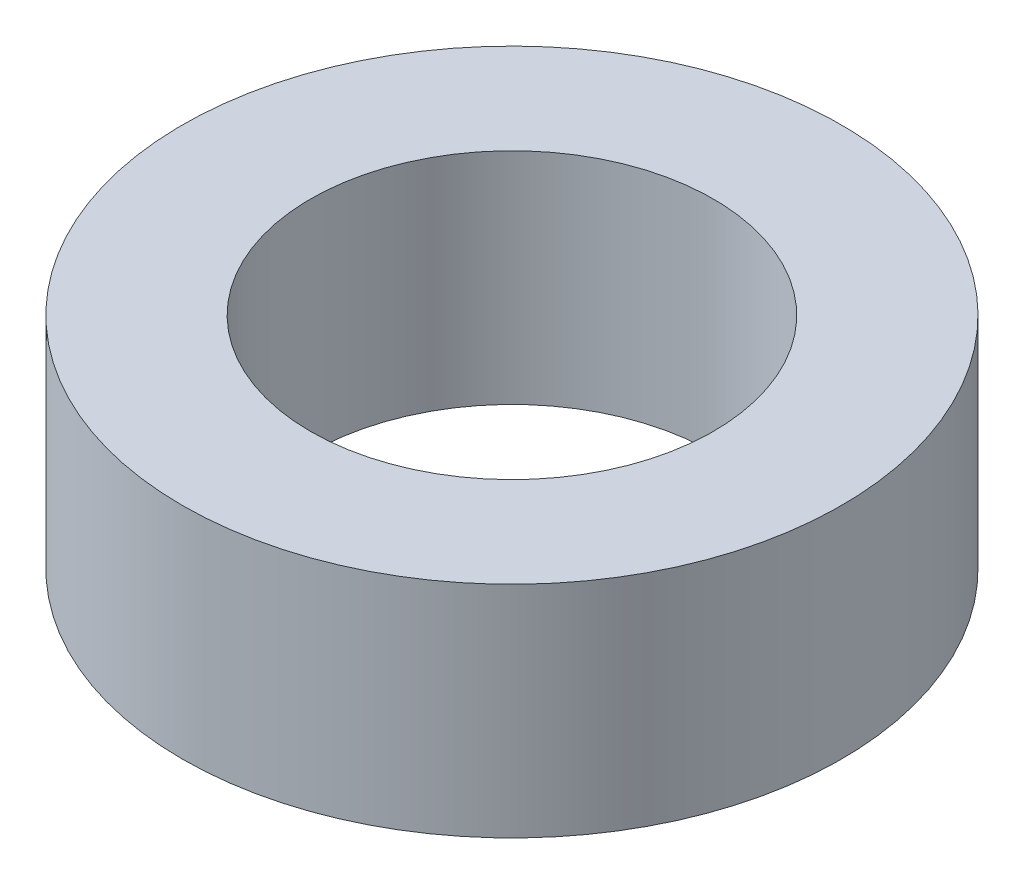
ISO-10303-21;
HEADER;
FILE_DESCRIPTION(('STEP AP214'),'2;1');
FILE_NAME('part.step','',(''),(''),'','','');
FILE_SCHEMA(('AUTOMOTIVE_DESIGN { 1 0 10303 214 1 1 1 1 }'));
ENDSEC;
DATA;
#1=APPLICATION_CONTEXT('core data for automotive mechanical design processes');
#2=APPLICATION_PROTOCOL_DEFINITION('international standard','automotive_design',2000,#1);
#3=PRODUCT_CONTEXT('',#1,'mechanical');
#4=PRODUCT('Part','Part','',(#3));
#5=PRODUCT_RELATED_PRODUCT_CATEGORY('part','',(#4));
#6=PRODUCT_DEFINITION_FORMATION('','',#4);
#7=PRODUCT_DEFINITION_CONTEXT('part definition',#1,'design');
#8=PRODUCT_DEFINITION('design','',#6,#7);
#9=PRODUCT_DEFINITION_SHAPE('','',#8);
#10=(LENGTH_UNIT() NAMED_UNIT(*) SI_UNIT(.MILLI.,.METRE.));
#11=(NAMED_UNIT(*) PLANE_ANGLE_UNIT() SI_UNIT($,.RADIAN.));
#12=(NAMED_UNIT(*) SI_UNIT($,.STERADIAN.) SOLID_ANGLE_UNIT());
#13=UNCERTAINTY_MEASURE_WITH_UNIT(LENGTH_MEASURE(1.E-05),#10,'distance_accuracy_value','');
#14=(GEOMETRIC_REPRESENTATION_CONTEXT(3) GLOBAL_UNCERTAINTY_ASSIGNED_CONTEXT((#13)) GLOBAL_UNIT_ASSIGNED_CONTEXT((#10,
#11,#12)) REPRESENTATION_CONTEXT('',''));
#15=CARTESIAN_POINT('',(0.,0.,0.));
#16=DIRECTION('',(0.,0.,1.));
#17=DIRECTION('',(1.,0.,0.));
#18=AXIS2_PLACEMENT_3D('',#15,#16,#17);
#19=CARTESIAN_POINT('',(0.,3.,0.));
#20=DIRECTION('',(0.,1.,0.));
#21=DIRECTION('',(0.,0.,1.));
#22=AXIS2_PLACEMENT_3D('',#19,#20,#21);
#23=PLANE('',#22);
#24=CARTESIAN_POINT('',(0.,3.,0.));
#25=DIRECTION('',(0.,1.,0.));
#26=DIRECTION('',(0.,0.,1.));
#27=AXIS2_PLACEMENT_3D('',#24,#25,#26);
#28=CIRCLE('',#27,4.5);
#29=CARTESIAN_POINT('',(0.,3.,4.5));
#30=VERTEX_POINT('',#29);
#31=EDGE_CURVE('E10',#30,#30,#28,.T.);
#32=ORIENTED_EDGE('',*,*,#31,.T.);
#33=EDGE_LOOP('',(#32));
#34=FACE_BOUND('',#33,.T.);
#35=CARTESIAN_POINT('',(0.,3.,0.));
#36=DIRECTION('',(0.,1.,0.));
#37=DIRECTION('',(0.,0.,1.));
#38=AXIS2_PLACEMENT_3D('',#35,#36,#37);
#39=CIRCLE('',#38,2.75);
#40=CARTESIAN_POINT('',(0.,3.,2.75));
#41=VERTEX_POINT('',#40);
#42=EDGE_CURVE('E52',#41,#41,#39,.T.);
#43=ORIENTED_EDGE('',*,*,#42,.F.);
#44=EDGE_LOOP('',(#43));
#45=FACE_BOUND('',#44,.T.);
#46=ADVANCED_FACE('F41',(#34,#45),#23,.T.);
#47=CARTESIAN_POINT('',(0.,0.,0.));
#48=DIRECTION('',(0.,1.,0.));
#49=DIRECTION('',(0.,0.,1.));
#50=AXIS2_PLACEMENT_3D('',#47,#48,#49);
#51=PLANE('',#50);
#52=CARTESIAN_POINT('',(0.,0.,0.));
#53=DIRECTION('',(0.,1.,0.));
#54=DIRECTION('',(0.,0.,1.));
#55=AXIS2_PLACEMENT_3D('',#52,#53,#54);
#56=CIRCLE('',#55,4.5);
#57=CARTESIAN_POINT('',(0.,0.,4.5));
#58=VERTEX_POINT('',#57);
#59=EDGE_CURVE('E45',#58,#58,#56,.T.);
#60=ORIENTED_EDGE('',*,*,#59,.F.);
#61=EDGE_LOOP('',(#60));
#62=FACE_BOUND('',#61,.T.);
#63=CARTESIAN_POINT('',(0.,0.,0.));
#64=DIRECTION('',(0.,1.,0.));
#65=DIRECTION('',(0.,0.,1.));
#66=AXIS2_PLACEMENT_3D('',#63,#64,#65);
#67=CIRCLE('',#66,2.75);
#68=CARTESIAN_POINT('',(0.,0.,2.75));
#69=VERTEX_POINT('',#68);
#70=EDGE_CURVE('E54',#69,#69,#67,.T.);
#71=ORIENTED_EDGE('',*,*,#70,.T.);
#72=EDGE_LOOP('',(#71));
#73=FACE_BOUND('',#72,.T.);
#74=ADVANCED_FACE('F64',(#62,#73),#51,.F.);
#75=CARTESIAN_POINT('',(0.,3.,0.));
#76=DIRECTION('',(0.,-1.,0.));
#77=DIRECTION('',(0.,0.,-1.));
#78=AXIS2_PLACEMENT_3D('',#75,#76,#77);
#79=CYLINDRICAL_SURFACE('',#78,4.5);
#80=ORIENTED_EDGE('',*,*,#31,.F.);
#81=EDGE_LOOP('',(#80));
#82=FACE_BOUND('',#81,.T.);
#83=ORIENTED_EDGE('',*,*,#59,.T.);
#84=EDGE_LOOP('',(#83));
#85=FACE_BOUND('',#84,.T.);
#86=ADVANCED_FACE('F43',(#82,#85),#79,.T.);
#87=CARTESIAN_POINT('',(0.,3.,0.));
#88=DIRECTION('',(0.,-1.,0.));
#89=DIRECTION('',(0.,0.,-1.));
#90=AXIS2_PLACEMENT_3D('',#87,#88,#89);
#91=CYLINDRICAL_SURFACE('',#90,2.75);
#92=ORIENTED_EDGE('',*,*,#42,.T.);
#93=EDGE_LOOP('',(#92));
#94=FACE_BOUND('',#93,.T.);
#95=ORIENTED_EDGE('',*,*,#70,.F.);
#96=EDGE_LOOP('',(#95));
#97=FACE_BOUND('',#96,.T.);
#98=ADVANCED_FACE('F60',(#94,#97),#91,.F.);
#99=CLOSED_SHELL('',(#46,#74,#86,#98));
#100=MANIFOLD_SOLID_BREP('B2',#99);
#101=ADVANCED_BREP_SHAPE_REPRESENTATION('',(#18,#100),#14);
#102=SHAPE_DEFINITION_REPRESENTATION(#9,#101);
ENDSEC;
END-ISO-10303-21;
